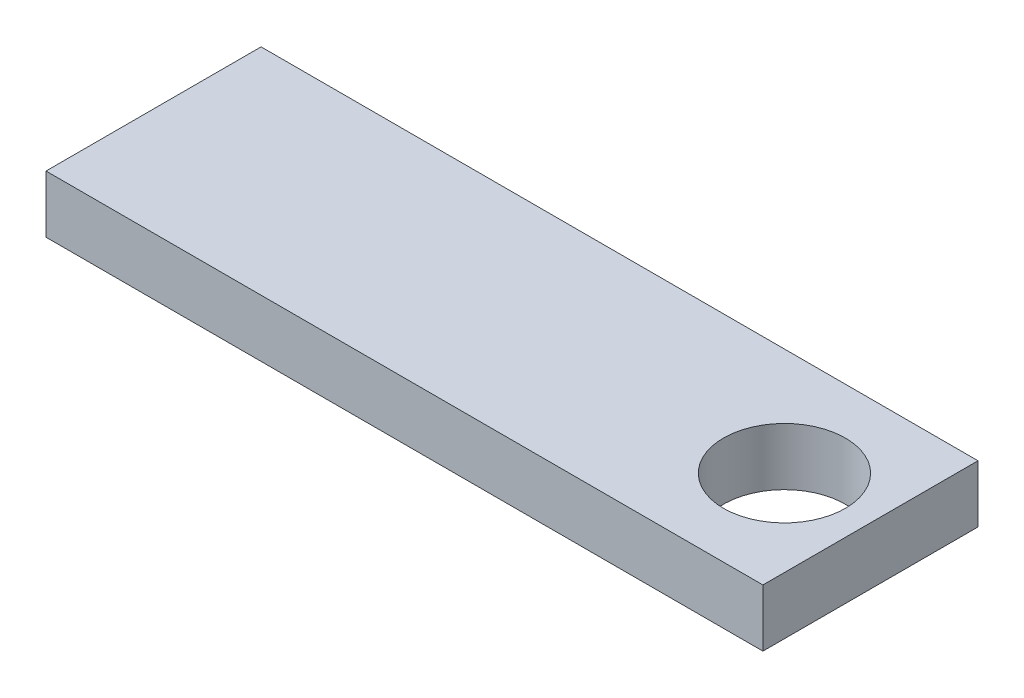
ISO-10303-21;
HEADER;
FILE_DESCRIPTION(('STEP AP214'),'2;1');
FILE_NAME('part.step','',(''),(''),'','','');
FILE_SCHEMA(('AUTOMOTIVE_DESIGN { 1 0 10303 214 1 1 1 1 }'));
ENDSEC;
DATA;
#1=APPLICATION_CONTEXT('core data for automotive mechanical design processes');
#2=APPLICATION_PROTOCOL_DEFINITION('international standard','automotive_design',2000,#1);
#3=PRODUCT_CONTEXT('',#1,'mechanical');
#4=PRODUCT('Part','Part','',(#3));
#5=PRODUCT_RELATED_PRODUCT_CATEGORY('part','',(#4));
#6=PRODUCT_DEFINITION_FORMATION('','',#4);
#7=PRODUCT_DEFINITION_CONTEXT('part definition',#1,'design');
#8=PRODUCT_DEFINITION('design','',#6,#7);
#9=PRODUCT_DEFINITION_SHAPE('','',#8);
#10=(LENGTH_UNIT() NAMED_UNIT(*) SI_UNIT(.MILLI.,.METRE.));
#11=(NAMED_UNIT(*) PLANE_ANGLE_UNIT() SI_UNIT($,.RADIAN.));
#12=(NAMED_UNIT(*) SI_UNIT($,.STERADIAN.) SOLID_ANGLE_UNIT());
#13=UNCERTAINTY_MEASURE_WITH_UNIT(LENGTH_MEASURE(1.E-05),#10,'distance_accuracy_value','');
#14=(GEOMETRIC_REPRESENTATION_CONTEXT(3) GLOBAL_UNCERTAINTY_ASSIGNED_CONTEXT((#13)) GLOBAL_UNIT_ASSIGNED_CONTEXT((#10,
#11,#12)) REPRESENTATION_CONTEXT('',''));
#15=CARTESIAN_POINT('',(0.,0.,0.));
#16=DIRECTION('',(0.,0.,1.));
#17=DIRECTION('',(1.,0.,0.));
#18=AXIS2_PLACEMENT_3D('',#15,#16,#17);
#19=CARTESIAN_POINT('',(-25.,4.,7.5));
#20=DIRECTION('',(0.,0.,-1.));
#21=DIRECTION('',(-1.,0.,0.));
#22=AXIS2_PLACEMENT_3D('',#19,#20,#21);
#23=PLANE('',#22);
#24=DIRECTION('',(1.,0.,0.));
#25=VECTOR('',#24,1.);
#26=CARTESIAN_POINT('',(-25.,0.,7.5));
#27=LINE('',#26,#25);
#28=CARTESIAN_POINT('',(-25.,0.,7.5));
#29=VERTEX_POINT('',#28);
#30=CARTESIAN_POINT('',(25.,0.,7.5));
#31=VERTEX_POINT('',#30);
#32=EDGE_CURVE('E96',#29,#31,#27,.T.);
#33=ORIENTED_EDGE('',*,*,#32,.T.);
#34=DIRECTION('',(0.,-1.,0.));
#35=VECTOR('',#34,1.);
#36=CARTESIAN_POINT('',(25.,4.,7.5));
#37=LINE('',#36,#35);
#38=CARTESIAN_POINT('',(25.,4.,7.5));
#39=VERTEX_POINT('',#38);
#40=EDGE_CURVE('E11',#39,#31,#37,.T.);
#41=ORIENTED_EDGE('',*,*,#40,.F.);
#42=DIRECTION('',(1.,0.,0.));
#43=VECTOR('',#42,1.);
#44=CARTESIAN_POINT('',(-25.,4.,7.5));
#45=LINE('',#44,#43);
#46=CARTESIAN_POINT('',(-25.,4.,7.5));
#47=VERTEX_POINT('',#46);
#48=EDGE_CURVE('E84',#47,#39,#45,.T.);
#49=ORIENTED_EDGE('',*,*,#48,.F.);
#50=DIRECTION('',(0.,-1.,0.));
#51=VECTOR('',#50,1.);
#52=CARTESIAN_POINT('',(-25.,4.,7.5));
#53=LINE('',#52,#51);
#54=EDGE_CURVE('E92',#47,#29,#53,.T.);
#55=ORIENTED_EDGE('',*,*,#54,.T.);
#56=EDGE_LOOP('',(#33,#41,#49,#55));
#57=FACE_BOUND('',#56,.T.);
#58=ADVANCED_FACE('F33',(#57),#23,.F.);
#59=CARTESIAN_POINT('',(25.,4.,7.5));
#60=DIRECTION('',(-1.,0.,0.));
#61=DIRECTION('',(0.,0.,1.));
#62=AXIS2_PLACEMENT_3D('',#59,#60,#61);
#63=PLANE('',#62);
#64=DIRECTION('',(0.,0.,-1.));
#65=VECTOR('',#64,1.);
#66=CARTESIAN_POINT('',(25.,0.,7.5));
#67=LINE('',#66,#65);
#68=CARTESIAN_POINT('',(25.,0.,-7.5));
#69=VERTEX_POINT('',#68);
#70=EDGE_CURVE('E88',#31,#69,#67,.T.);
#71=ORIENTED_EDGE('',*,*,#70,.T.);
#72=DIRECTION('',(0.,-1.,0.));
#73=VECTOR('',#72,1.);
#74=CARTESIAN_POINT('',(25.,4.,-7.5));
#75=LINE('',#74,#73);
#76=CARTESIAN_POINT('',(25.,4.,-7.5));
#77=VERTEX_POINT('',#76);
#78=EDGE_CURVE('E41',#77,#69,#75,.T.);
#79=ORIENTED_EDGE('',*,*,#78,.F.);
#80=DIRECTION('',(0.,0.,-1.));
#81=VECTOR('',#80,1.);
#82=CARTESIAN_POINT('',(25.,4.,7.5));
#83=LINE('',#82,#81);
#84=EDGE_CURVE('E79',#39,#77,#83,.T.);
#85=ORIENTED_EDGE('',*,*,#84,.F.);
#86=ORIENTED_EDGE('',*,*,#40,.T.);
#87=EDGE_LOOP('',(#71,#79,#85,#86));
#88=FACE_BOUND('',#87,.T.);
#89=ADVANCED_FACE('F87',(#88),#63,.F.);
#90=CARTESIAN_POINT('',(-25.,4.,-7.5));
#91=DIRECTION('',(0.,0.,1.));
#92=DIRECTION('',(1.,0.,0.));
#93=AXIS2_PLACEMENT_3D('',#90,#91,#92);
#94=PLANE('',#93);
#95=DIRECTION('',(-1.,0.,0.));
#96=VECTOR('',#95,1.);
#97=CARTESIAN_POINT('',(-25.,0.,-7.5));
#98=LINE('',#97,#96);
#99=CARTESIAN_POINT('',(-25.,0.,-7.5));
#100=VERTEX_POINT('',#99);
#101=EDGE_CURVE('E66',#69,#100,#98,.T.);
#102=ORIENTED_EDGE('',*,*,#101,.T.);
#103=DIRECTION('',(0.,-1.,0.));
#104=VECTOR('',#103,1.);
#105=CARTESIAN_POINT('',(-25.,4.,-7.5));
#106=LINE('',#105,#104);
#107=CARTESIAN_POINT('',(-25.,4.,-7.5));
#108=VERTEX_POINT('',#107);
#109=EDGE_CURVE('E89',#108,#100,#106,.T.);
#110=ORIENTED_EDGE('',*,*,#109,.F.);
#111=DIRECTION('',(-1.,0.,0.));
#112=VECTOR('',#111,1.);
#113=CARTESIAN_POINT('',(-25.,4.,-7.5));
#114=LINE('',#113,#112);
#115=EDGE_CURVE('E82',#77,#108,#114,.T.);
#116=ORIENTED_EDGE('',*,*,#115,.F.);
#117=ORIENTED_EDGE('',*,*,#78,.T.);
#118=EDGE_LOOP('',(#102,#110,#116,#117));
#119=FACE_BOUND('',#118,.T.);
#120=ADVANCED_FACE('F90',(#119),#94,.F.);
#121=CARTESIAN_POINT('',(-25.,4.,7.5));
#122=DIRECTION('',(1.,0.,0.));
#123=DIRECTION('',(0.,0.,-1.));
#124=AXIS2_PLACEMENT_3D('',#121,#122,#123);
#125=PLANE('',#124);
#126=DIRECTION('',(0.,0.,1.));
#127=VECTOR('',#126,1.);
#128=CARTESIAN_POINT('',(-25.,0.,7.5));
#129=LINE('',#128,#127);
#130=EDGE_CURVE('E72',#100,#29,#129,.T.);
#131=ORIENTED_EDGE('',*,*,#130,.T.);
#132=ORIENTED_EDGE('',*,*,#54,.F.);
#133=DIRECTION('',(0.,0.,1.));
#134=VECTOR('',#133,1.);
#135=CARTESIAN_POINT('',(-25.,4.,7.5));
#136=LINE('',#135,#134);
#137=EDGE_CURVE('E49',#108,#47,#136,.T.);
#138=ORIENTED_EDGE('',*,*,#137,.F.);
#139=ORIENTED_EDGE('',*,*,#109,.T.);
#140=EDGE_LOOP('',(#131,#132,#138,#139));
#141=FACE_BOUND('',#140,.T.);
#142=ADVANCED_FACE('F104',(#141),#125,.F.);
#143=CARTESIAN_POINT('',(0.,4.,0.));
#144=DIRECTION('',(0.,1.,0.));
#145=DIRECTION('',(0.,0.,1.));
#146=AXIS2_PLACEMENT_3D('',#143,#144,#145);
#147=PLANE('',#146);
#148=CARTESIAN_POINT('',(19.,4.,0.));
#149=DIRECTION('',(0.,1.,0.));
#150=DIRECTION('',(0.,0.,1.));
#151=AXIS2_PLACEMENT_3D('',#148,#149,#150);
#152=CIRCLE('',#151,4.25);
#153=CARTESIAN_POINT('',(19.,4.,4.25));
#154=VERTEX_POINT('',#153);
#155=EDGE_CURVE('E110',#154,#154,#152,.T.);
#156=ORIENTED_EDGE('',*,*,#155,.F.);
#157=EDGE_LOOP('',(#156));
#158=FACE_BOUND('',#157,.T.);
#159=ORIENTED_EDGE('',*,*,#48,.T.);
#160=ORIENTED_EDGE('',*,*,#84,.T.);
#161=ORIENTED_EDGE('',*,*,#115,.T.);
#162=ORIENTED_EDGE('',*,*,#137,.T.);
#163=EDGE_LOOP('',(#159,#160,#161,#162));
#164=FACE_BOUND('',#163,.T.);
#165=ADVANCED_FACE('F80',(#158,#164),#147,.T.);
#166=CARTESIAN_POINT('',(0.,0.,0.));
#167=DIRECTION('',(0.,1.,0.));
#168=DIRECTION('',(0.,0.,1.));
#169=AXIS2_PLACEMENT_3D('',#166,#167,#168);
#170=PLANE('',#169);
#171=CARTESIAN_POINT('',(19.,0.,0.));
#172=DIRECTION('',(0.,1.,0.));
#173=DIRECTION('',(0.,0.,1.));
#174=AXIS2_PLACEMENT_3D('',#171,#172,#173);
#175=CIRCLE('',#174,4.25);
#176=CARTESIAN_POINT('',(19.,0.,4.25));
#177=VERTEX_POINT('',#176);
#178=EDGE_CURVE('E99',#177,#177,#175,.T.);
#179=ORIENTED_EDGE('',*,*,#178,.T.);
#180=EDGE_LOOP('',(#179));
#181=FACE_BOUND('',#180,.T.);
#182=ORIENTED_EDGE('',*,*,#32,.F.);
#183=ORIENTED_EDGE('',*,*,#130,.F.);
#184=ORIENTED_EDGE('',*,*,#101,.F.);
#185=ORIENTED_EDGE('',*,*,#70,.F.);
#186=EDGE_LOOP('',(#182,#183,#184,#185));
#187=FACE_BOUND('',#186,.T.);
#188=ADVANCED_FACE('F107',(#181,#187),#170,.F.);
#189=CARTESIAN_POINT('',(19.,0.,0.));
#190=DIRECTION('',(0.,1.,0.));
#191=DIRECTION('',(0.,0.,1.));
#192=AXIS2_PLACEMENT_3D('',#189,#190,#191);
#193=CYLINDRICAL_SURFACE('',#192,4.25);
#194=ORIENTED_EDGE('',*,*,#178,.F.);
#195=EDGE_LOOP('',(#194));
#196=FACE_BOUND('',#195,.T.);
#197=ORIENTED_EDGE('',*,*,#155,.T.);
#198=EDGE_LOOP('',(#197));
#199=FACE_BOUND('',#198,.T.);
#200=ADVANCED_FACE('F117',(#196,#199),#193,.F.);
#201=CLOSED_SHELL('',(#58,#89,#120,#142,#165,#188,#200));
#202=MANIFOLD_SOLID_BREP('B2',#201);
#203=ADVANCED_BREP_SHAPE_REPRESENTATION('',(#18,#202),#14);
#204=SHAPE_DEFINITION_REPRESENTATION(#9,#203);
ENDSEC;
END-ISO-10303-21;
